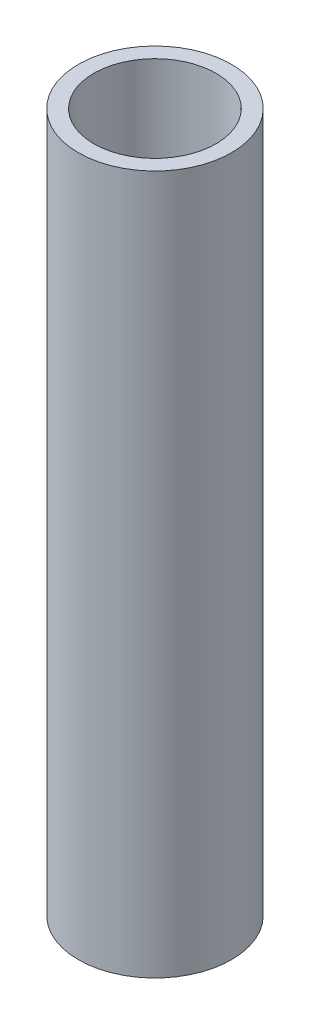
ISO-10303-21;
HEADER;
FILE_DESCRIPTION(('STEP AP214'),'2;1');
FILE_NAME('part.step','',(''),(''),'','','');
FILE_SCHEMA(('AUTOMOTIVE_DESIGN { 1 0 10303 214 1 1 1 1 }'));
ENDSEC;
DATA;
#1=APPLICATION_CONTEXT('core data for automotive mechanical design processes');
#2=APPLICATION_PROTOCOL_DEFINITION('international standard','automotive_design',2000,#1);
#3=PRODUCT_CONTEXT('',#1,'mechanical');
#4=PRODUCT('Part','Part','',(#3));
#5=PRODUCT_RELATED_PRODUCT_CATEGORY('part','',(#4));
#6=PRODUCT_DEFINITION_FORMATION('','',#4);
#7=PRODUCT_DEFINITION_CONTEXT('part definition',#1,'design');
#8=PRODUCT_DEFINITION('design','',#6,#7);
#9=PRODUCT_DEFINITION_SHAPE('','',#8);
#10=(LENGTH_UNIT() NAMED_UNIT(*) SI_UNIT(.MILLI.,.METRE.));
#11=(NAMED_UNIT(*) PLANE_ANGLE_UNIT() SI_UNIT($,.RADIAN.));
#12=(NAMED_UNIT(*) SI_UNIT($,.STERADIAN.) SOLID_ANGLE_UNIT());
#13=UNCERTAINTY_MEASURE_WITH_UNIT(LENGTH_MEASURE(1.E-05),#10,'distance_accuracy_value','');
#14=(GEOMETRIC_REPRESENTATION_CONTEXT(3) GLOBAL_UNCERTAINTY_ASSIGNED_CONTEXT((#13)) GLOBAL_UNIT_ASSIGNED_CONTEXT((#10,
#11,#12)) REPRESENTATION_CONTEXT('',''));
#15=CARTESIAN_POINT('',(0.,0.,0.));
#16=DIRECTION('',(0.,0.,1.));
#17=DIRECTION('',(1.,0.,0.));
#18=AXIS2_PLACEMENT_3D('',#15,#16,#17);
#19=CARTESIAN_POINT('',(0.,-76.2,0.));
#20=DIRECTION('',(0.,1.,0.));
#21=DIRECTION('',(0.,0.,1.));
#22=AXIS2_PLACEMENT_3D('',#19,#20,#21);
#23=CYLINDRICAL_SURFACE('',#22,13.3223);
#24=CARTESIAN_POINT('',(0.,76.2,0.));
#25=DIRECTION('',(0.,1.,0.));
#26=DIRECTION('',(0.,0.,1.));
#27=AXIS2_PLACEMENT_3D('',#24,#25,#26);
#28=CIRCLE('',#27,13.3223);
#29=CARTESIAN_POINT('',(0.,76.2,13.3223));
#30=VERTEX_POINT('',#29);
#31=EDGE_CURVE('E18',#30,#30,#28,.F.);
#32=ORIENTED_EDGE('',*,*,#31,.F.);
#33=EDGE_LOOP('',(#32));
#34=FACE_BOUND('',#33,.T.);
#35=CARTESIAN_POINT('',(0.,-76.2,0.));
#36=DIRECTION('',(0.,1.,0.));
#37=DIRECTION('',(0.,0.,1.));
#38=AXIS2_PLACEMENT_3D('',#35,#36,#37);
#39=CIRCLE('',#38,13.3223);
#40=CARTESIAN_POINT('',(0.,-76.2,13.3223));
#41=VERTEX_POINT('',#40);
#42=EDGE_CURVE('E27',#41,#41,#39,.F.);
#43=ORIENTED_EDGE('',*,*,#42,.T.);
#44=EDGE_LOOP('',(#43));
#45=FACE_BOUND('',#44,.T.);
#46=ADVANCED_FACE('F15',(#34,#45),#23,.F.);
#47=CARTESIAN_POINT('',(0.,76.2,0.));
#48=DIRECTION('',(0.,1.,0.));
#49=DIRECTION('',(0.,0.,1.));
#50=AXIS2_PLACEMENT_3D('',#47,#48,#49);
#51=PLANE('',#50);
#52=ORIENTED_EDGE('',*,*,#31,.T.);
#53=EDGE_LOOP('',(#52));
#54=FACE_BOUND('',#53,.T.);
#55=CARTESIAN_POINT('',(0.,76.2,0.));
#56=DIRECTION('',(0.,1.,0.));
#57=DIRECTION('',(0.,0.,1.));
#58=AXIS2_PLACEMENT_3D('',#55,#56,#57);
#59=CIRCLE('',#58,16.7005);
#60=CARTESIAN_POINT('',(0.,76.2,16.7005));
#61=VERTEX_POINT('',#60);
#62=EDGE_CURVE('E22',#61,#61,#59,.F.);
#63=ORIENTED_EDGE('',*,*,#62,.F.);
#64=EDGE_LOOP('',(#63));
#65=FACE_BOUND('',#64,.T.);
#66=ADVANCED_FACE('F35',(#54,#65),#51,.T.);
#67=CARTESIAN_POINT('',(0.,-76.2,0.));
#68=DIRECTION('',(0.,1.,0.));
#69=DIRECTION('',(0.,0.,1.));
#70=AXIS2_PLACEMENT_3D('',#67,#68,#69);
#71=PLANE('',#70);
#72=ORIENTED_EDGE('',*,*,#42,.F.);
#73=EDGE_LOOP('',(#72));
#74=FACE_BOUND('',#73,.T.);
#75=CARTESIAN_POINT('',(0.,-76.2,0.));
#76=DIRECTION('',(0.,1.,0.));
#77=DIRECTION('',(0.,0.,1.));
#78=AXIS2_PLACEMENT_3D('',#75,#76,#77);
#79=CIRCLE('',#78,16.7005);
#80=CARTESIAN_POINT('',(0.,-76.2,16.7005));
#81=VERTEX_POINT('',#80);
#82=EDGE_CURVE('E10',#81,#81,#79,.T.);
#83=ORIENTED_EDGE('',*,*,#82,.F.);
#84=EDGE_LOOP('',(#83));
#85=FACE_BOUND('',#84,.T.);
#86=ADVANCED_FACE('F43',(#74,#85),#71,.F.);
#87=CARTESIAN_POINT('',(0.,-76.2,0.));
#88=DIRECTION('',(0.,1.,0.));
#89=DIRECTION('',(0.,0.,1.));
#90=AXIS2_PLACEMENT_3D('',#87,#88,#89);
#91=CYLINDRICAL_SURFACE('',#90,16.7005);
#92=ORIENTED_EDGE('',*,*,#62,.T.);
#93=EDGE_LOOP('',(#92));
#94=FACE_BOUND('',#93,.T.);
#95=ORIENTED_EDGE('',*,*,#82,.T.);
#96=EDGE_LOOP('',(#95));
#97=FACE_BOUND('',#96,.T.);
#98=ADVANCED_FACE('F44',(#94,#97),#91,.T.);
#99=CLOSED_SHELL('',(#46,#66,#86,#98));
#100=MANIFOLD_SOLID_BREP('B1',#99);
#101=ADVANCED_BREP_SHAPE_REPRESENTATION('',(#18,#100),#14);
#102=SHAPE_DEFINITION_REPRESENTATION(#9,#101);
ENDSEC;
END-ISO-10303-21;
